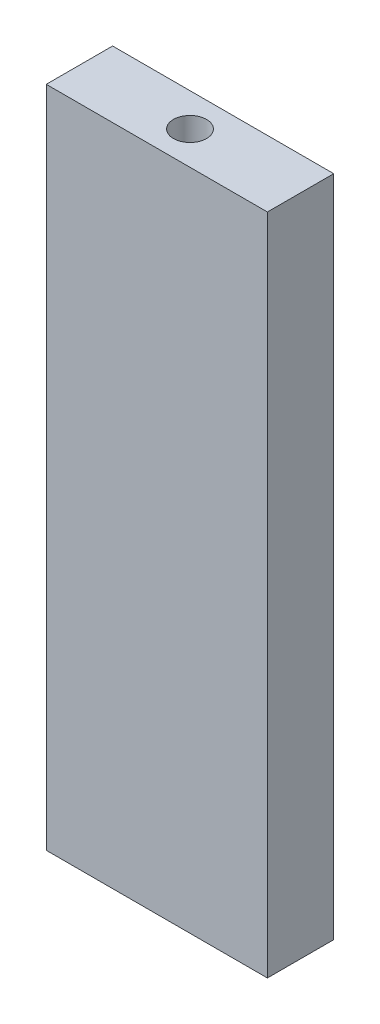
ISO-10303-21;
HEADER;
FILE_DESCRIPTION(('STEP AP214'),'2;1');
FILE_NAME('part.step','',(''),(''),'','','');
FILE_SCHEMA(('AUTOMOTIVE_DESIGN { 1 0 10303 214 1 1 1 1 }'));
ENDSEC;
DATA;
#1=APPLICATION_CONTEXT('core data for automotive mechanical design processes');
#2=APPLICATION_PROTOCOL_DEFINITION('international standard','automotive_design',2000,#1);
#3=PRODUCT_CONTEXT('',#1,'mechanical');
#4=PRODUCT('Part','Part','',(#3));
#5=PRODUCT_RELATED_PRODUCT_CATEGORY('part','',(#4));
#6=PRODUCT_DEFINITION_FORMATION('','',#4);
#7=PRODUCT_DEFINITION_CONTEXT('part definition',#1,'design');
#8=PRODUCT_DEFINITION('design','',#6,#7);
#9=PRODUCT_DEFINITION_SHAPE('','',#8);
#10=(LENGTH_UNIT() NAMED_UNIT(*) SI_UNIT(.MILLI.,.METRE.));
#11=(NAMED_UNIT(*) PLANE_ANGLE_UNIT() SI_UNIT($,.RADIAN.));
#12=(NAMED_UNIT(*) SI_UNIT($,.STERADIAN.) SOLID_ANGLE_UNIT());
#13=UNCERTAINTY_MEASURE_WITH_UNIT(LENGTH_MEASURE(1.E-05),#10,'distance_accuracy_value','');
#14=(GEOMETRIC_REPRESENTATION_CONTEXT(3) GLOBAL_UNCERTAINTY_ASSIGNED_CONTEXT((#13)) GLOBAL_UNIT_ASSIGNED_CONTEXT((#10,
#11,#12)) REPRESENTATION_CONTEXT('',''));
#15=CARTESIAN_POINT('',(0.,0.,0.));
#16=DIRECTION('',(0.,0.,1.));
#17=DIRECTION('',(1.,0.,0.));
#18=AXIS2_PLACEMENT_3D('',#15,#16,#17);
#19=CARTESIAN_POINT('',(9.99999999999999,30.,6.));
#20=DIRECTION('',(-1.,0.,0.));
#21=DIRECTION('',(0.,-1.,0.));
#22=AXIS2_PLACEMENT_3D('',#19,#20,#21);
#23=PLANE('',#22);
#24=DIRECTION('',(0.,1.,0.));
#25=VECTOR('',#24,1.);
#26=CARTESIAN_POINT('',(9.99999999999999,30.,0.));
#27=LINE('',#26,#25);
#28=CARTESIAN_POINT('',(10.,-30.,0.));
#29=VERTEX_POINT('',#28);
#30=CARTESIAN_POINT('',(9.99999999999999,30.,0.));
#31=VERTEX_POINT('',#30);
#32=EDGE_CURVE('E96',#29,#31,#27,.T.);
#33=ORIENTED_EDGE('',*,*,#32,.T.);
#34=DIRECTION('',(0.,0.,-1.));
#35=VECTOR('',#34,1.);
#36=CARTESIAN_POINT('',(9.99999999999999,30.,6.));
#37=LINE('',#36,#35);
#38=CARTESIAN_POINT('',(9.99999999999999,30.,6.));
#39=VERTEX_POINT('',#38);
#40=EDGE_CURVE('E11',#39,#31,#37,.T.);
#41=ORIENTED_EDGE('',*,*,#40,.F.);
#42=DIRECTION('',(0.,1.,0.));
#43=VECTOR('',#42,1.);
#44=CARTESIAN_POINT('',(9.99999999999999,30.,6.));
#45=LINE('',#44,#43);
#46=CARTESIAN_POINT('',(10.,-30.,6.));
#47=VERTEX_POINT('',#46);
#48=EDGE_CURVE('E84',#47,#39,#45,.T.);
#49=ORIENTED_EDGE('',*,*,#48,.F.);
#50=DIRECTION('',(0.,0.,-1.));
#51=VECTOR('',#50,1.);
#52=CARTESIAN_POINT('',(10.,-30.,6.));
#53=LINE('',#52,#51);
#54=EDGE_CURVE('E92',#47,#29,#53,.T.);
#55=ORIENTED_EDGE('',*,*,#54,.T.);
#56=EDGE_LOOP('',(#33,#41,#49,#55));
#57=FACE_BOUND('',#56,.T.);
#58=ADVANCED_FACE('F33',(#57),#23,.F.);
#59=CARTESIAN_POINT('',(-10.,30.,6.));
#60=DIRECTION('',(0.,-1.,0.));
#61=DIRECTION('',(0.,0.,-1.));
#62=AXIS2_PLACEMENT_3D('',#59,#60,#61);
#63=PLANE('',#62);
#64=CARTESIAN_POINT('',(0.,30.,3.));
#65=DIRECTION('',(0.,1.,0.));
#66=DIRECTION('',(0.,0.,1.));
#67=AXIS2_PLACEMENT_3D('',#64,#65,#66);
#68=CIRCLE('',#67,1.5);
#69=CARTESIAN_POINT('',(0.,30.,4.5));
#70=VERTEX_POINT('',#69);
#71=EDGE_CURVE('E110',#70,#70,#68,.T.);
#72=ORIENTED_EDGE('',*,*,#71,.F.);
#73=EDGE_LOOP('',(#72));
#74=FACE_BOUND('',#73,.T.);
#75=DIRECTION('',(-1.,0.,0.));
#76=VECTOR('',#75,1.);
#77=CARTESIAN_POINT('',(-10.,30.,0.));
#78=LINE('',#77,#76);
#79=CARTESIAN_POINT('',(-10.,30.,0.));
#80=VERTEX_POINT('',#79);
#81=EDGE_CURVE('E88',#31,#80,#78,.T.);
#82=ORIENTED_EDGE('',*,*,#81,.T.);
#83=DIRECTION('',(0.,0.,-1.));
#84=VECTOR('',#83,1.);
#85=CARTESIAN_POINT('',(-10.,30.,6.));
#86=LINE('',#85,#84);
#87=CARTESIAN_POINT('',(-10.,30.,6.));
#88=VERTEX_POINT('',#87);
#89=EDGE_CURVE('E41',#88,#80,#86,.T.);
#90=ORIENTED_EDGE('',*,*,#89,.F.);
#91=DIRECTION('',(-1.,0.,0.));
#92=VECTOR('',#91,1.);
#93=CARTESIAN_POINT('',(-10.,30.,6.));
#94=LINE('',#93,#92);
#95=EDGE_CURVE('E79',#39,#88,#94,.T.);
#96=ORIENTED_EDGE('',*,*,#95,.F.);
#97=ORIENTED_EDGE('',*,*,#40,.T.);
#98=EDGE_LOOP('',(#82,#90,#96,#97));
#99=FACE_BOUND('',#98,.T.);
#100=ADVANCED_FACE('F87',(#74,#99),#63,.F.);
#101=CARTESIAN_POINT('',(-10.,30.,6.));
#102=DIRECTION('',(1.,0.,0.));
#103=DIRECTION('',(0.,1.,0.));
#104=AXIS2_PLACEMENT_3D('',#101,#102,#103);
#105=PLANE('',#104);
#106=DIRECTION('',(0.,-1.,0.));
#107=VECTOR('',#106,1.);
#108=CARTESIAN_POINT('',(-10.,30.,0.));
#109=LINE('',#108,#107);
#110=CARTESIAN_POINT('',(-10.,-30.,0.));
#111=VERTEX_POINT('',#110);
#112=EDGE_CURVE('E66',#80,#111,#109,.T.);
#113=ORIENTED_EDGE('',*,*,#112,.T.);
#114=DIRECTION('',(0.,0.,-1.));
#115=VECTOR('',#114,1.);
#116=CARTESIAN_POINT('',(-10.,-30.,6.));
#117=LINE('',#116,#115);
#118=CARTESIAN_POINT('',(-10.,-30.,6.));
#119=VERTEX_POINT('',#118);
#120=EDGE_CURVE('E89',#119,#111,#117,.T.);
#121=ORIENTED_EDGE('',*,*,#120,.F.);
#122=DIRECTION('',(0.,-1.,0.));
#123=VECTOR('',#122,1.);
#124=CARTESIAN_POINT('',(-10.,30.,6.));
#125=LINE('',#124,#123);
#126=EDGE_CURVE('E82',#88,#119,#125,.T.);
#127=ORIENTED_EDGE('',*,*,#126,.F.);
#128=ORIENTED_EDGE('',*,*,#89,.T.);
#129=EDGE_LOOP('',(#113,#121,#127,#128));
#130=FACE_BOUND('',#129,.T.);
#131=ADVANCED_FACE('F90',(#130),#105,.F.);
#132=CARTESIAN_POINT('',(-10.,-30.,6.));
#133=DIRECTION('',(0.,1.,0.));
#134=DIRECTION('',(0.,0.,1.));
#135=AXIS2_PLACEMENT_3D('',#132,#133,#134);
#136=PLANE('',#135);
#137=CARTESIAN_POINT('',(0.,-30.,3.));
#138=DIRECTION('',(0.,1.,0.));
#139=DIRECTION('',(0.,0.,1.));
#140=AXIS2_PLACEMENT_3D('',#137,#138,#139);
#141=CIRCLE('',#140,1.5);
#142=CARTESIAN_POINT('',(0.,-30.,4.5));
#143=VERTEX_POINT('',#142);
#144=EDGE_CURVE('E116',#143,#143,#141,.T.);
#145=ORIENTED_EDGE('',*,*,#144,.T.);
#146=EDGE_LOOP('',(#145));
#147=FACE_BOUND('',#146,.T.);
#148=DIRECTION('',(1.,0.,0.));
#149=VECTOR('',#148,1.);
#150=CARTESIAN_POINT('',(-10.,-30.,0.));
#151=LINE('',#150,#149);
#152=EDGE_CURVE('E72',#111,#29,#151,.T.);
#153=ORIENTED_EDGE('',*,*,#152,.T.);
#154=ORIENTED_EDGE('',*,*,#54,.F.);
#155=DIRECTION('',(1.,0.,0.));
#156=VECTOR('',#155,1.);
#157=CARTESIAN_POINT('',(-10.,-30.,6.));
#158=LINE('',#157,#156);
#159=EDGE_CURVE('E49',#119,#47,#158,.T.);
#160=ORIENTED_EDGE('',*,*,#159,.F.);
#161=ORIENTED_EDGE('',*,*,#120,.T.);
#162=EDGE_LOOP('',(#153,#154,#160,#161));
#163=FACE_BOUND('',#162,.T.);
#164=ADVANCED_FACE('F104',(#147,#163),#136,.F.);
#165=CARTESIAN_POINT('',(0.,0.,6.));
#166=DIRECTION('',(0.,0.,1.));
#167=DIRECTION('',(1.,0.,0.));
#168=AXIS2_PLACEMENT_3D('',#165,#166,#167);
#169=PLANE('',#168);
#170=ORIENTED_EDGE('',*,*,#48,.T.);
#171=ORIENTED_EDGE('',*,*,#95,.T.);
#172=ORIENTED_EDGE('',*,*,#126,.T.);
#173=ORIENTED_EDGE('',*,*,#159,.T.);
#174=EDGE_LOOP('',(#170,#171,#172,#173));
#175=FACE_BOUND('',#174,.T.);
#176=ADVANCED_FACE('F80',(#175),#169,.T.);
#177=CARTESIAN_POINT('',(0.,0.,0.));
#178=DIRECTION('',(0.,0.,1.));
#179=DIRECTION('',(1.,0.,0.));
#180=AXIS2_PLACEMENT_3D('',#177,#178,#179);
#181=PLANE('',#180);
#182=ORIENTED_EDGE('',*,*,#32,.F.);
#183=ORIENTED_EDGE('',*,*,#152,.F.);
#184=ORIENTED_EDGE('',*,*,#112,.F.);
#185=ORIENTED_EDGE('',*,*,#81,.F.);
#186=EDGE_LOOP('',(#182,#183,#184,#185));
#187=FACE_BOUND('',#186,.T.);
#188=ADVANCED_FACE('F107',(#187),#181,.F.);
#189=CARTESIAN_POINT('',(0.,20.,3.));
#190=DIRECTION('',(0.,1.,0.));
#191=DIRECTION('',(0.,0.,1.));
#192=AXIS2_PLACEMENT_3D('',#189,#190,#191);
#193=CYLINDRICAL_SURFACE('',#192,1.5);
#194=CARTESIAN_POINT('',(0.,20.,3.));
#195=DIRECTION('',(0.,1.,0.));
#196=DIRECTION('',(0.,0.,1.));
#197=AXIS2_PLACEMENT_3D('',#194,#195,#196);
#198=CIRCLE('',#197,1.5);
#199=CARTESIAN_POINT('',(0.,20.,4.5));
#200=VERTEX_POINT('',#199);
#201=EDGE_CURVE('E99',#200,#200,#198,.T.);
#202=ORIENTED_EDGE('',*,*,#201,.F.);
#203=EDGE_LOOP('',(#202));
#204=FACE_BOUND('',#203,.T.);
#205=ORIENTED_EDGE('',*,*,#71,.T.);
#206=EDGE_LOOP('',(#205));
#207=FACE_BOUND('',#206,.T.);
#208=ADVANCED_FACE('F149',(#204,#207),#193,.F.);
#209=CARTESIAN_POINT('',(0.,20.,3.));
#210=DIRECTION('',(0.,1.,0.));
#211=DIRECTION('',(0.,0.,1.));
#212=AXIS2_PLACEMENT_3D('',#209,#210,#211);
#213=PLANE('',#212);
#214=ORIENTED_EDGE('',*,*,#201,.T.);
#215=EDGE_LOOP('',(#214));
#216=FACE_BOUND('',#215,.T.);
#217=ADVANCED_FACE('F131',(#216),#213,.T.);
#218=CARTESIAN_POINT('',(0.,-20.,3.));
#219=DIRECTION('',(0.,-1.,0.));
#220=DIRECTION('',(0.,0.,-1.));
#221=AXIS2_PLACEMENT_3D('',#218,#219,#220);
#222=CYLINDRICAL_SURFACE('',#221,1.5);
#223=CARTESIAN_POINT('',(0.,-20.,3.));
#224=DIRECTION('',(0.,1.,0.));
#225=DIRECTION('',(0.,0.,1.));
#226=AXIS2_PLACEMENT_3D('',#223,#224,#225);
#227=CIRCLE('',#226,1.5);
#228=CARTESIAN_POINT('',(0.,-20.,4.5));
#229=VERTEX_POINT('',#228);
#230=EDGE_CURVE('E113',#229,#229,#227,.T.);
#231=ORIENTED_EDGE('',*,*,#230,.T.);
#232=EDGE_LOOP('',(#231));
#233=FACE_BOUND('',#232,.T.);
#234=ORIENTED_EDGE('',*,*,#144,.F.);
#235=EDGE_LOOP('',(#234));
#236=FACE_BOUND('',#235,.T.);
#237=ADVANCED_FACE('F122',(#233,#236),#222,.F.);
#238=CARTESIAN_POINT('',(0.,-20.,3.));
#239=DIRECTION('',(0.,-1.,0.));
#240=DIRECTION('',(0.,0.,1.));
#241=AXIS2_PLACEMENT_3D('',#238,#239,#240);
#242=PLANE('',#241);
#243=ORIENTED_EDGE('',*,*,#230,.F.);
#244=EDGE_LOOP('',(#243));
#245=FACE_BOUND('',#244,.T.);
#246=ADVANCED_FACE('F125',(#245),#242,.T.);
#247=CLOSED_SHELL('',(#58,#100,#131,#164,#176,#188,#208,#217,#237,#246));
#248=MANIFOLD_SOLID_BREP('B2',#247);
#249=ADVANCED_BREP_SHAPE_REPRESENTATION('',(#18,#248),#14);
#250=SHAPE_DEFINITION_REPRESENTATION(#9,#249);
ENDSEC;
END-ISO-10303-21;
